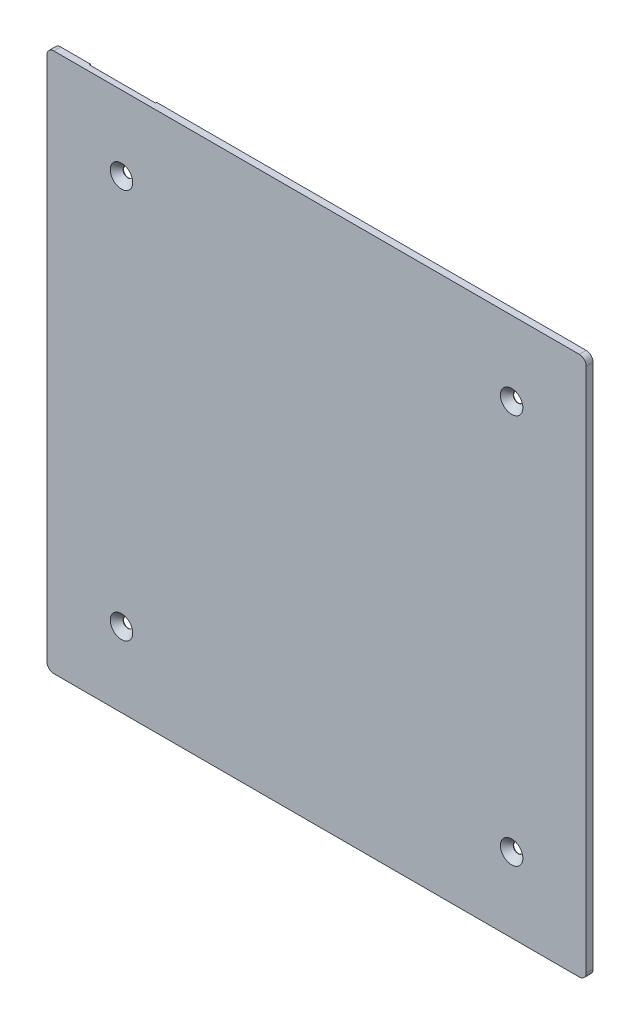
ISO-10303-21;
HEADER;
FILE_DESCRIPTION(('STEP AP214'),'2;1');
FILE_NAME('part.step','',(''),(''),'','','');
FILE_SCHEMA(('AUTOMOTIVE_DESIGN { 1 0 10303 214 1 1 1 1 }'));
ENDSEC;
DATA;
#1=APPLICATION_CONTEXT('core data for automotive mechanical design processes');
#2=APPLICATION_PROTOCOL_DEFINITION('international standard','automotive_design',2000,#1);
#3=PRODUCT_CONTEXT('',#1,'mechanical');
#4=PRODUCT('Part','Part','',(#3));
#5=PRODUCT_RELATED_PRODUCT_CATEGORY('part','',(#4));
#6=PRODUCT_DEFINITION_FORMATION('','',#4);
#7=PRODUCT_DEFINITION_CONTEXT('part definition',#1,'design');
#8=PRODUCT_DEFINITION('design','',#6,#7);
#9=PRODUCT_DEFINITION_SHAPE('','',#8);
#10=(LENGTH_UNIT() NAMED_UNIT(*) SI_UNIT(.MILLI.,.METRE.));
#11=(NAMED_UNIT(*) PLANE_ANGLE_UNIT() SI_UNIT($,.RADIAN.));
#12=(NAMED_UNIT(*) SI_UNIT($,.STERADIAN.) SOLID_ANGLE_UNIT());
#13=UNCERTAINTY_MEASURE_WITH_UNIT(LENGTH_MEASURE(1.E-05),#10,'distance_accuracy_value','');
#14=(GEOMETRIC_REPRESENTATION_CONTEXT(3) GLOBAL_UNCERTAINTY_ASSIGNED_CONTEXT((#13)) GLOBAL_UNIT_ASSIGNED_CONTEXT((#10,
#11,#12)) REPRESENTATION_CONTEXT('',''));
#15=CARTESIAN_POINT('',(0.,0.,0.));
#16=DIRECTION('',(0.,0.,1.));
#17=DIRECTION('',(1.,0.,0.));
#18=AXIS2_PLACEMENT_3D('',#15,#16,#17);
#19=CARTESIAN_POINT('',(-72.6507614869108,117.5,0.5));
#20=DIRECTION('',(1.,0.,0.));
#21=DIRECTION('',(0.,0.,-1.));
#22=AXIS2_PLACEMENT_3D('',#19,#20,#21);
#23=PLANE('',#22);
#24=DIRECTION('',(0.,0.,-1.));
#25=VECTOR('',#24,1.);
#26=CARTESIAN_POINT('',(-72.6507614869108,106.050790199477,0.5));
#27=LINE('',#26,#25);
#28=CARTESIAN_POINT('',(-72.6507614869108,106.050790199477,0.));
#29=VERTEX_POINT('',#28);
#30=CARTESIAN_POINT('',(-72.6507614869108,106.050790199477,0.5));
#31=VERTEX_POINT('',#30);
#32=EDGE_CURVE('E184',#29,#31,#27,.F.);
#33=ORIENTED_EDGE('',*,*,#32,.T.);
#34=DIRECTION('',(0.,1.,0.));
#35=VECTOR('',#34,1.);
#36=CARTESIAN_POINT('',(-72.6507614869108,0.,0.5));
#37=LINE('',#36,#35);
#38=CARTESIAN_POINT('',(-72.6507614869108,117.5,0.5));
#39=VERTEX_POINT('',#38);
#40=EDGE_CURVE('E118',#39,#31,#37,.F.);
#41=ORIENTED_EDGE('',*,*,#40,.F.);
#42=DIRECTION('',(0.,0.,-1.));
#43=VECTOR('',#42,1.);
#44=CARTESIAN_POINT('',(-72.6507614869108,117.5,0.5));
#45=LINE('',#44,#43);
#46=CARTESIAN_POINT('',(-72.6507614869108,117.5,0.));
#47=VERTEX_POINT('',#46);
#48=EDGE_CURVE('E114',#47,#39,#45,.F.);
#49=ORIENTED_EDGE('',*,*,#48,.F.);
#50=DIRECTION('',(0.,1.,0.));
#51=VECTOR('',#50,1.);
#52=CARTESIAN_POINT('',(-72.6507614869108,0.,0.));
#53=LINE('',#52,#51);
#54=EDGE_CURVE('E117',#29,#47,#53,.T.);
#55=ORIENTED_EDGE('',*,*,#54,.F.);
#56=EDGE_LOOP('',(#33,#41,#49,#55));
#57=FACE_BOUND('',#56,.T.);
#58=ADVANCED_FACE('F17',(#57),#23,.F.);
#59=CARTESIAN_POINT('',(-101.46292574176,117.5,0.5));
#60=DIRECTION('',(-1.,0.,0.));
#61=DIRECTION('',(0.,0.,1.));
#62=AXIS2_PLACEMENT_3D('',#59,#60,#61);
#63=PLANE('',#62);
#64=DIRECTION('',(0.,0.,1.));
#65=VECTOR('',#64,1.);
#66=CARTESIAN_POINT('',(-101.46292574176,117.5,0.5));
#67=LINE('',#66,#65);
#68=CARTESIAN_POINT('',(-101.46292574176,117.5,0.5));
#69=VERTEX_POINT('',#68);
#70=CARTESIAN_POINT('',(-101.46292574176,117.5,0.));
#71=VERTEX_POINT('',#70);
#72=EDGE_CURVE('E124',#69,#71,#67,.F.);
#73=ORIENTED_EDGE('',*,*,#72,.F.);
#74=DIRECTION('',(0.,1.,0.));
#75=VECTOR('',#74,1.);
#76=CARTESIAN_POINT('',(-101.46292574176,0.,0.5));
#77=LINE('',#76,#75);
#78=CARTESIAN_POINT('',(-101.46292574176,106.050790199477,0.5));
#79=VERTEX_POINT('',#78);
#80=EDGE_CURVE('E133',#79,#69,#77,.T.);
#81=ORIENTED_EDGE('',*,*,#80,.F.);
#82=DIRECTION('',(0.,0.,-1.));
#83=VECTOR('',#82,1.);
#84=CARTESIAN_POINT('',(-101.46292574176,106.050790199477,0.5));
#85=LINE('',#84,#83);
#86=CARTESIAN_POINT('',(-101.46292574176,106.050790199477,0.));
#87=VERTEX_POINT('',#86);
#88=EDGE_CURVE('E187',#79,#87,#85,.T.);
#89=ORIENTED_EDGE('',*,*,#88,.T.);
#90=DIRECTION('',(0.,1.,0.));
#91=VECTOR('',#90,1.);
#92=CARTESIAN_POINT('',(-101.46292574176,0.,0.));
#93=LINE('',#92,#91);
#94=EDGE_CURVE('E95',#71,#87,#93,.F.);
#95=ORIENTED_EDGE('',*,*,#94,.F.);
#96=EDGE_LOOP('',(#73,#81,#89,#95));
#97=FACE_BOUND('',#96,.T.);
#98=ADVANCED_FACE('F372',(#97),#63,.F.);
#99=CARTESIAN_POINT('',(-72.6507614869108,106.050790199477,0.5));
#100=DIRECTION('',(0.,-1.,0.));
#101=DIRECTION('',(0.,0.,-1.));
#102=AXIS2_PLACEMENT_3D('',#99,#100,#101);
#103=PLANE('',#102);
#104=ORIENTED_EDGE('',*,*,#88,.F.);
#105=DIRECTION('',(-1.,0.,0.));
#106=VECTOR('',#105,1.);
#107=CARTESIAN_POINT('',(0.,106.050790199477,0.5));
#108=LINE('',#107,#106);
#109=EDGE_CURVE('E202',#31,#79,#108,.T.);
#110=ORIENTED_EDGE('',*,*,#109,.F.);
#111=ORIENTED_EDGE('',*,*,#32,.F.);
#112=DIRECTION('',(-1.,0.,0.));
#113=VECTOR('',#112,1.);
#114=CARTESIAN_POINT('',(0.,106.050790199477,0.));
#115=LINE('',#114,#113);
#116=EDGE_CURVE('E131',#87,#29,#115,.F.);
#117=ORIENTED_EDGE('',*,*,#116,.F.);
#118=EDGE_LOOP('',(#104,#110,#111,#117));
#119=FACE_BOUND('',#118,.T.);
#120=ADVANCED_FACE('F285',(#119),#103,.F.);
#121=CARTESIAN_POINT('',(-85.,-85.,3.));
#122=DIRECTION('',(0.,0.,-1.));
#123=DIRECTION('',(-1.,0.,0.));
#124=AXIS2_PLACEMENT_3D('',#121,#122,#123);
#125=CYLINDRICAL_SURFACE('',#124,2.1);
#126=CARTESIAN_POINT('',(-85.,-85.,0.));
#127=DIRECTION('',(0.,0.,-1.));
#128=DIRECTION('',(-1.,0.,0.));
#129=AXIS2_PLACEMENT_3D('',#126,#127,#128);
#130=CIRCLE('',#129,2.1);
#131=CARTESIAN_POINT('',(-87.1,-85.,0.));
#132=VERTEX_POINT('',#131);
#133=EDGE_CURVE('E20',#132,#132,#130,.F.);
#134=ORIENTED_EDGE('',*,*,#133,.F.);
#135=EDGE_LOOP('',(#134));
#136=FACE_BOUND('',#135,.T.);
#137=CARTESIAN_POINT('',(-85.,-85.,0.200000000006639));
#138=DIRECTION('',(0.,0.,1.));
#139=DIRECTION('',(1.,0.,0.));
#140=AXIS2_PLACEMENT_3D('',#137,#138,#139);
#141=CIRCLE('',#140,2.09999999994806);
#142=CARTESIAN_POINT('',(-82.9000000000519,-85.,0.200000000006639));
#143=VERTEX_POINT('',#142);
#144=EDGE_CURVE('E177',#143,#143,#141,.T.);
#145=ORIENTED_EDGE('',*,*,#144,.T.);
#146=EDGE_LOOP('',(#145));
#147=FACE_BOUND('',#146,.T.);
#148=ADVANCED_FACE('F281',(#136,#147),#125,.F.);
#149=CARTESIAN_POINT('',(85.,-85.,3.));
#150=DIRECTION('',(0.,0.,-1.));
#151=DIRECTION('',(-1.,0.,0.));
#152=AXIS2_PLACEMENT_3D('',#149,#150,#151);
#153=CYLINDRICAL_SURFACE('',#152,2.1);
#154=CARTESIAN_POINT('',(85.,-85.,0.));
#155=DIRECTION('',(0.,0.,-1.));
#156=DIRECTION('',(-1.,0.,0.));
#157=AXIS2_PLACEMENT_3D('',#154,#155,#156);
#158=CIRCLE('',#157,2.1);
#159=CARTESIAN_POINT('',(82.9,-85.,0.));
#160=VERTEX_POINT('',#159);
#161=EDGE_CURVE('E181',#160,#160,#158,.F.);
#162=ORIENTED_EDGE('',*,*,#161,.F.);
#163=EDGE_LOOP('',(#162));
#164=FACE_BOUND('',#163,.T.);
#165=CARTESIAN_POINT('',(85.,-85.,0.200000000006639));
#166=DIRECTION('',(0.,0.,1.));
#167=DIRECTION('',(1.,0.,0.));
#168=AXIS2_PLACEMENT_3D('',#165,#166,#167);
#169=CIRCLE('',#168,2.09999999996396);
#170=CARTESIAN_POINT('',(87.099999999964,-85.,0.200000000006639));
#171=VERTEX_POINT('',#170);
#172=EDGE_CURVE('E173',#171,#171,#169,.T.);
#173=ORIENTED_EDGE('',*,*,#172,.T.);
#174=EDGE_LOOP('',(#173));
#175=FACE_BOUND('',#174,.T.);
#176=ADVANCED_FACE('F284',(#164,#175),#153,.F.);
#177=CARTESIAN_POINT('',(85.,85.,3.));
#178=DIRECTION('',(0.,0.,-1.));
#179=DIRECTION('',(-1.,0.,0.));
#180=AXIS2_PLACEMENT_3D('',#177,#178,#179);
#181=CYLINDRICAL_SURFACE('',#180,2.1);
#182=CARTESIAN_POINT('',(85.,85.,0.));
#183=DIRECTION('',(0.,0.,-1.));
#184=DIRECTION('',(-1.,0.,0.));
#185=AXIS2_PLACEMENT_3D('',#182,#183,#184);
#186=CIRCLE('',#185,2.1);
#187=CARTESIAN_POINT('',(82.9,85.,0.));
#188=VERTEX_POINT('',#187);
#189=EDGE_CURVE('E268',#188,#188,#186,.F.);
#190=ORIENTED_EDGE('',*,*,#189,.F.);
#191=EDGE_LOOP('',(#190));
#192=FACE_BOUND('',#191,.T.);
#193=CARTESIAN_POINT('',(85.,85.,0.200000000006639));
#194=DIRECTION('',(0.,0.,1.));
#195=DIRECTION('',(1.,0.,0.));
#196=AXIS2_PLACEMENT_3D('',#193,#194,#195);
#197=CIRCLE('',#196,2.09999999996396);
#198=CARTESIAN_POINT('',(87.099999999964,85.,0.200000000006639));
#199=VERTEX_POINT('',#198);
#200=EDGE_CURVE('E169',#199,#199,#197,.T.);
#201=ORIENTED_EDGE('',*,*,#200,.T.);
#202=EDGE_LOOP('',(#201));
#203=FACE_BOUND('',#202,.T.);
#204=ADVANCED_FACE('F355',(#192,#203),#181,.F.);
#205=CARTESIAN_POINT('',(-85.,85.,3.));
#206=DIRECTION('',(0.,0.,-1.));
#207=DIRECTION('',(-1.,0.,0.));
#208=AXIS2_PLACEMENT_3D('',#205,#206,#207);
#209=CYLINDRICAL_SURFACE('',#208,2.1);
#210=CARTESIAN_POINT('',(-85.,85.,0.));
#211=DIRECTION('',(0.,0.,-1.));
#212=DIRECTION('',(-1.,0.,0.));
#213=AXIS2_PLACEMENT_3D('',#210,#211,#212);
#214=CIRCLE('',#213,2.1);
#215=CARTESIAN_POINT('',(-87.1,85.,0.));
#216=VERTEX_POINT('',#215);
#217=EDGE_CURVE('E271',#216,#216,#214,.F.);
#218=ORIENTED_EDGE('',*,*,#217,.F.);
#219=EDGE_LOOP('',(#218));
#220=FACE_BOUND('',#219,.T.);
#221=CARTESIAN_POINT('',(-85.,85.,0.200000000006639));
#222=DIRECTION('',(0.,0.,1.));
#223=DIRECTION('',(1.,0.,0.));
#224=AXIS2_PLACEMENT_3D('',#221,#222,#223);
#225=CIRCLE('',#224,2.09999999994806);
#226=CARTESIAN_POINT('',(-82.9000000000519,85.,0.200000000006639));
#227=VERTEX_POINT('',#226);
#228=EDGE_CURVE('E165',#227,#227,#225,.T.);
#229=ORIENTED_EDGE('',*,*,#228,.T.);
#230=EDGE_LOOP('',(#229));
#231=FACE_BOUND('',#230,.T.);
#232=ADVANCED_FACE('F357',(#220,#231),#209,.F.);
#233=CARTESIAN_POINT('',(0.,0.,0.5));
#234=DIRECTION('',(0.,0.,-1.));
#235=DIRECTION('',(-1.,0.,0.));
#236=AXIS2_PLACEMENT_3D('',#233,#234,#235);
#237=PLANE('',#236);
#238=ORIENTED_EDGE('',*,*,#80,.T.);
#239=DIRECTION('',(1.,0.,0.));
#240=VECTOR('',#239,1.);
#241=CARTESIAN_POINT('',(-117.5,117.5,0.5));
#242=LINE('',#241,#240);
#243=EDGE_CURVE('E140',#69,#39,#242,.T.);
#244=ORIENTED_EDGE('',*,*,#243,.T.);
#245=ORIENTED_EDGE('',*,*,#40,.T.);
#246=ORIENTED_EDGE('',*,*,#109,.T.);
#247=EDGE_LOOP('',(#238,#244,#245,#246));
#248=FACE_BOUND('',#247,.T.);
#249=ADVANCED_FACE('F302',(#248),#237,.T.);
#250=CARTESIAN_POINT('',(0.,0.,0.));
#251=DIRECTION('',(0.,0.,-1.));
#252=DIRECTION('',(-1.,0.,0.));
#253=AXIS2_PLACEMENT_3D('',#250,#251,#252);
#254=PLANE('',#253);
#255=ORIENTED_EDGE('',*,*,#161,.T.);
#256=EDGE_LOOP('',(#255));
#257=FACE_BOUND('',#256,.T.);
#258=ORIENTED_EDGE('',*,*,#189,.T.);
#259=EDGE_LOOP('',(#258));
#260=FACE_BOUND('',#259,.T.);
#261=ORIENTED_EDGE('',*,*,#217,.T.);
#262=EDGE_LOOP('',(#261));
#263=FACE_BOUND('',#262,.T.);
#264=ORIENTED_EDGE('',*,*,#133,.T.);
#265=EDGE_LOOP('',(#264));
#266=FACE_BOUND('',#265,.T.);
#267=ORIENTED_EDGE('',*,*,#94,.T.);
#268=ORIENTED_EDGE('',*,*,#116,.T.);
#269=ORIENTED_EDGE('',*,*,#54,.T.);
#270=DIRECTION('',(1.,0.,0.));
#271=VECTOR('',#270,1.);
#272=CARTESIAN_POINT('',(-117.5,117.5,0.));
#273=LINE('',#272,#271);
#274=CARTESIAN_POINT('',(114.5,117.5,0.));
#275=VERTEX_POINT('',#274);
#276=EDGE_CURVE('E128',#47,#275,#273,.T.);
#277=ORIENTED_EDGE('',*,*,#276,.T.);
#278=CARTESIAN_POINT('',(114.5,114.5,0.));
#279=DIRECTION('',(0.,0.,-1.));
#280=DIRECTION('',(-1.,0.,0.));
#281=AXIS2_PLACEMENT_3D('',#278,#279,#280);
#282=CIRCLE('',#281,3.);
#283=CARTESIAN_POINT('',(117.5,114.5,0.));
#284=VERTEX_POINT('',#283);
#285=EDGE_CURVE('E139',#284,#275,#282,.F.);
#286=ORIENTED_EDGE('',*,*,#285,.F.);
#287=DIRECTION('',(0.,1.,0.));
#288=VECTOR('',#287,1.);
#289=CARTESIAN_POINT('',(117.5,-117.5,0.));
#290=LINE('',#289,#288);
#291=CARTESIAN_POINT('',(117.5,-114.5,0.));
#292=VERTEX_POINT('',#291);
#293=EDGE_CURVE('E150',#284,#292,#290,.F.);
#294=ORIENTED_EDGE('',*,*,#293,.T.);
#295=CARTESIAN_POINT('',(114.5,-114.5,0.));
#296=DIRECTION('',(0.,0.,-1.));
#297=DIRECTION('',(-1.,0.,0.));
#298=AXIS2_PLACEMENT_3D('',#295,#296,#297);
#299=CIRCLE('',#298,3.);
#300=CARTESIAN_POINT('',(114.5,-117.5,0.));
#301=VERTEX_POINT('',#300);
#302=EDGE_CURVE('E259',#301,#292,#299,.F.);
#303=ORIENTED_EDGE('',*,*,#302,.F.);
#304=DIRECTION('',(1.,0.,0.));
#305=VECTOR('',#304,1.);
#306=CARTESIAN_POINT('',(-117.5,-117.5,0.));
#307=LINE('',#306,#305);
#308=CARTESIAN_POINT('',(-114.5,-117.5,0.));
#309=VERTEX_POINT('',#308);
#310=EDGE_CURVE('E258',#301,#309,#307,.F.);
#311=ORIENTED_EDGE('',*,*,#310,.T.);
#312=CARTESIAN_POINT('',(-114.5,-114.5,0.));
#313=DIRECTION('',(0.,0.,-1.));
#314=DIRECTION('',(-1.,0.,0.));
#315=AXIS2_PLACEMENT_3D('',#312,#313,#314);
#316=CIRCLE('',#315,3.);
#317=CARTESIAN_POINT('',(-117.5,-114.5,0.));
#318=VERTEX_POINT('',#317);
#319=EDGE_CURVE('E254',#318,#309,#316,.F.);
#320=ORIENTED_EDGE('',*,*,#319,.F.);
#321=DIRECTION('',(0.,1.,0.));
#322=VECTOR('',#321,1.);
#323=CARTESIAN_POINT('',(-117.5,-117.5,0.));
#324=LINE('',#323,#322);
#325=CARTESIAN_POINT('',(-117.5,114.5,0.));
#326=VERTEX_POINT('',#325);
#327=EDGE_CURVE('E253',#318,#326,#324,.T.);
#328=ORIENTED_EDGE('',*,*,#327,.T.);
#329=CARTESIAN_POINT('',(-114.5,114.5,0.));
#330=DIRECTION('',(0.,0.,-1.));
#331=DIRECTION('',(-1.,0.,0.));
#332=AXIS2_PLACEMENT_3D('',#329,#330,#331);
#333=CIRCLE('',#332,3.);
#334=CARTESIAN_POINT('',(-114.5,117.5,0.));
#335=VERTEX_POINT('',#334);
#336=EDGE_CURVE('E85',#335,#326,#333,.F.);
#337=ORIENTED_EDGE('',*,*,#336,.F.);
#338=DIRECTION('',(1.,0.,0.));
#339=VECTOR('',#338,1.);
#340=CARTESIAN_POINT('',(-117.5,117.5,0.));
#341=LINE('',#340,#339);
#342=EDGE_CURVE('E146',#335,#71,#341,.T.);
#343=ORIENTED_EDGE('',*,*,#342,.T.);
#344=EDGE_LOOP('',(#267,#268,#269,#277,#286,#294,#303,#311,#320,#328,#337,#343));
#345=FACE_BOUND('',#344,.T.);
#346=ADVANCED_FACE('F127',(#257,#260,#263,#266,#345),#254,.T.);
#347=CARTESIAN_POINT('',(-85.,-85.,2.9999999999859));
#348=DIRECTION('',(0.,0.,1.));
#349=DIRECTION('',(1.,0.,0.));
#350=AXIS2_PLACEMENT_3D('',#347,#348,#349);
#351=CONICAL_SURFACE('',#350,4.89999999998417,0.785398163407599);
#352=CARTESIAN_POINT('',(-85.,-85.,3.00000000002229));
#353=DIRECTION('',(0.,0.,1.));
#354=DIRECTION('',(1.,0.,0.));
#355=AXIS2_PLACEMENT_3D('',#352,#353,#354);
#356=CIRCLE('',#355,4.90000000002055);
#357=CARTESIAN_POINT('',(-80.0999999999794,-85.,3.00000000002229));
#358=VERTEX_POINT('',#357);
#359=EDGE_CURVE('E249',#358,#358,#356,.T.);
#360=ORIENTED_EDGE('',*,*,#359,.T.);
#361=EDGE_LOOP('',(#360));
#362=FACE_BOUND('',#361,.T.);
#363=ORIENTED_EDGE('',*,*,#144,.F.);
#364=EDGE_LOOP('',(#363));
#365=FACE_BOUND('',#364,.T.);
#366=ADVANCED_FACE('F289',(#362,#365),#351,.F.);
#367=CARTESIAN_POINT('',(85.,-85.,2.99999999987222));
#368=DIRECTION('',(0.,0.,1.));
#369=DIRECTION('',(0.,-1.,0.));
#370=AXIS2_PLACEMENT_3D('',#367,#368,#369);
#371=CONICAL_SURFACE('',#370,4.89999999988638,0.785398163397448);
#372=CARTESIAN_POINT('',(85.,-85.,2.9999999999859));
#373=DIRECTION('',(0.,0.,1.));
#374=DIRECTION('',(0.,-1.,0.));
#375=AXIS2_PLACEMENT_3D('',#372,#373,#374);
#376=CIRCLE('',#375,4.90000000000007);
#377=CARTESIAN_POINT('',(85.,-89.9000000000001,2.9999999999859));
#378=VERTEX_POINT('',#377);
#379=EDGE_CURVE('E245',#378,#378,#376,.T.);
#380=ORIENTED_EDGE('',*,*,#379,.T.);
#381=EDGE_LOOP('',(#380));
#382=FACE_BOUND('',#381,.T.);
#383=ORIENTED_EDGE('',*,*,#172,.F.);
#384=EDGE_LOOP('',(#383));
#385=FACE_BOUND('',#384,.T.);
#386=ADVANCED_FACE('F291',(#382,#385),#371,.F.);
#387=CARTESIAN_POINT('',(85.,85.,2.99999999987222));
#388=DIRECTION('',(0.,0.,1.));
#389=DIRECTION('',(0.,-1.,0.));
#390=AXIS2_PLACEMENT_3D('',#387,#388,#389);
#391=CONICAL_SURFACE('',#390,4.89999999988638,0.785398163397448);
#392=CARTESIAN_POINT('',(85.,85.,2.9999999999859));
#393=DIRECTION('',(0.,0.,1.));
#394=DIRECTION('',(0.,-1.,0.));
#395=AXIS2_PLACEMENT_3D('',#392,#393,#394);
#396=CIRCLE('',#395,4.90000000000007);
#397=CARTESIAN_POINT('',(85.,80.1,2.9999999999859));
#398=VERTEX_POINT('',#397);
#399=EDGE_CURVE('E241',#398,#398,#396,.T.);
#400=ORIENTED_EDGE('',*,*,#399,.T.);
#401=EDGE_LOOP('',(#400));
#402=FACE_BOUND('',#401,.T.);
#403=ORIENTED_EDGE('',*,*,#200,.F.);
#404=EDGE_LOOP('',(#403));
#405=FACE_BOUND('',#404,.T.);
#406=ADVANCED_FACE('F299',(#402,#405),#391,.F.);
#407=CARTESIAN_POINT('',(-85.,85.,2.9999999999859));
#408=DIRECTION('',(0.,0.,1.));
#409=DIRECTION('',(1.,0.,0.));
#410=AXIS2_PLACEMENT_3D('',#407,#408,#409);
#411=CONICAL_SURFACE('',#410,4.89999999998417,0.785398163407599);
#412=CARTESIAN_POINT('',(-85.,85.,3.00000000002229));
#413=DIRECTION('',(0.,0.,1.));
#414=DIRECTION('',(1.,0.,0.));
#415=AXIS2_PLACEMENT_3D('',#412,#413,#414);
#416=CIRCLE('',#415,4.90000000002055);
#417=CARTESIAN_POINT('',(-80.0999999999794,85.,3.00000000002229));
#418=VERTEX_POINT('',#417);
#419=EDGE_CURVE('E237',#418,#418,#416,.T.);
#420=ORIENTED_EDGE('',*,*,#419,.T.);
#421=EDGE_LOOP('',(#420));
#422=FACE_BOUND('',#421,.T.);
#423=ORIENTED_EDGE('',*,*,#228,.F.);
#424=EDGE_LOOP('',(#423));
#425=FACE_BOUND('',#424,.T.);
#426=ADVANCED_FACE('F342',(#422,#425),#411,.F.);
#427=CARTESIAN_POINT('',(-114.5,114.5,3.));
#428=DIRECTION('',(0.,0.,-1.));
#429=DIRECTION('',(-1.,0.,0.));
#430=AXIS2_PLACEMENT_3D('',#427,#428,#429);
#431=CYLINDRICAL_SURFACE('',#430,3.);
#432=ORIENTED_EDGE('',*,*,#336,.T.);
#433=DIRECTION('',(0.,0.,-1.));
#434=VECTOR('',#433,1.);
#435=CARTESIAN_POINT('',(-117.5,114.5,3.));
#436=LINE('',#435,#434);
#437=CARTESIAN_POINT('',(-117.5,114.5,3.));
#438=VERTEX_POINT('',#437);
#439=EDGE_CURVE('E553',#326,#438,#436,.F.);
#440=ORIENTED_EDGE('',*,*,#439,.T.);
#441=CARTESIAN_POINT('',(-114.5,114.5,3.));
#442=DIRECTION('',(0.,0.,-1.));
#443=DIRECTION('',(-1.,0.,0.));
#444=AXIS2_PLACEMENT_3D('',#441,#442,#443);
#445=CIRCLE('',#444,3.);
#446=CARTESIAN_POINT('',(-114.5,117.5,3.));
#447=VERTEX_POINT('',#446);
#448=EDGE_CURVE('E233',#438,#447,#445,.T.);
#449=ORIENTED_EDGE('',*,*,#448,.T.);
#450=DIRECTION('',(0.,0.,-1.));
#451=VECTOR('',#450,1.);
#452=CARTESIAN_POINT('',(-114.5,117.5,3.));
#453=LINE('',#452,#451);
#454=EDGE_CURVE('E158',#447,#335,#453,.T.);
#455=ORIENTED_EDGE('',*,*,#454,.T.);
#456=EDGE_LOOP('',(#432,#440,#449,#455));
#457=FACE_BOUND('',#456,.T.);
#458=ADVANCED_FACE('F339',(#457),#431,.T.);
#459=CARTESIAN_POINT('',(-117.5,117.5,3.));
#460=DIRECTION('',(0.,-1.,0.));
#461=DIRECTION('',(0.,0.,-1.));
#462=AXIS2_PLACEMENT_3D('',#459,#460,#461);
#463=PLANE('',#462);
#464=ORIENTED_EDGE('',*,*,#48,.T.);
#465=ORIENTED_EDGE('',*,*,#243,.F.);
#466=ORIENTED_EDGE('',*,*,#72,.T.);
#467=ORIENTED_EDGE('',*,*,#342,.F.);
#468=ORIENTED_EDGE('',*,*,#454,.F.);
#469=DIRECTION('',(-1.,0.,0.));
#470=VECTOR('',#469,1.);
#471=CARTESIAN_POINT('',(0.,117.5,3.));
#472=LINE('',#471,#470);
#473=CARTESIAN_POINT('',(114.5,117.5,3.));
#474=VERTEX_POINT('',#473);
#475=EDGE_CURVE('E232',#447,#474,#472,.F.);
#476=ORIENTED_EDGE('',*,*,#475,.T.);
#477=DIRECTION('',(0.,0.,-1.));
#478=VECTOR('',#477,1.);
#479=CARTESIAN_POINT('',(114.5,117.5,3.));
#480=LINE('',#479,#478);
#481=EDGE_CURVE('E137',#275,#474,#480,.F.);
#482=ORIENTED_EDGE('',*,*,#481,.F.);
#483=ORIENTED_EDGE('',*,*,#276,.F.);
#484=EDGE_LOOP('',(#464,#465,#466,#467,#468,#476,#482,#483));
#485=FACE_BOUND('',#484,.T.);
#486=ADVANCED_FACE('F135',(#485),#463,.F.);
#487=CARTESIAN_POINT('',(114.5,114.5,3.));
#488=DIRECTION('',(0.,0.,-1.));
#489=DIRECTION('',(-1.,0.,0.));
#490=AXIS2_PLACEMENT_3D('',#487,#488,#489);
#491=CYLINDRICAL_SURFACE('',#490,3.);
#492=ORIENTED_EDGE('',*,*,#285,.T.);
#493=ORIENTED_EDGE('',*,*,#481,.T.);
#494=CARTESIAN_POINT('',(114.5,114.5,3.));
#495=DIRECTION('',(0.,0.,-1.));
#496=DIRECTION('',(-1.,0.,0.));
#497=AXIS2_PLACEMENT_3D('',#494,#495,#496);
#498=CIRCLE('',#497,3.);
#499=CARTESIAN_POINT('',(117.5,114.5,3.));
#500=VERTEX_POINT('',#499);
#501=EDGE_CURVE('E228',#474,#500,#498,.T.);
#502=ORIENTED_EDGE('',*,*,#501,.T.);
#503=DIRECTION('',(0.,0.,1.));
#504=VECTOR('',#503,1.);
#505=CARTESIAN_POINT('',(117.5,114.5,3.));
#506=LINE('',#505,#504);
#507=EDGE_CURVE('E537',#500,#284,#506,.F.);
#508=ORIENTED_EDGE('',*,*,#507,.T.);
#509=EDGE_LOOP('',(#492,#493,#502,#508));
#510=FACE_BOUND('',#509,.T.);
#511=ADVANCED_FACE('F332',(#510),#491,.T.);
#512=CARTESIAN_POINT('',(117.5,-117.5,3.));
#513=DIRECTION('',(-1.,0.,0.));
#514=DIRECTION('',(0.,0.,1.));
#515=AXIS2_PLACEMENT_3D('',#512,#513,#514);
#516=PLANE('',#515);
#517=DIRECTION('',(0.,0.,-1.));
#518=VECTOR('',#517,1.);
#519=CARTESIAN_POINT('',(117.5,-114.5,3.));
#520=LINE('',#519,#518);
#521=CARTESIAN_POINT('',(117.5,-114.5,3.));
#522=VERTEX_POINT('',#521);
#523=EDGE_CURVE('E261',#292,#522,#520,.F.);
#524=ORIENTED_EDGE('',*,*,#523,.F.);
#525=ORIENTED_EDGE('',*,*,#293,.F.);
#526=ORIENTED_EDGE('',*,*,#507,.F.);
#527=DIRECTION('',(0.,1.,0.));
#528=VECTOR('',#527,1.);
#529=CARTESIAN_POINT('',(117.5,0.,3.));
#530=LINE('',#529,#528);
#531=EDGE_CURVE('E227',#500,#522,#530,.F.);
#532=ORIENTED_EDGE('',*,*,#531,.T.);
#533=EDGE_LOOP('',(#524,#525,#526,#532));
#534=FACE_BOUND('',#533,.T.);
#535=ADVANCED_FACE('F328',(#534),#516,.F.);
#536=CARTESIAN_POINT('',(114.5,-114.5,3.));
#537=DIRECTION('',(0.,0.,-1.));
#538=DIRECTION('',(-1.,0.,0.));
#539=AXIS2_PLACEMENT_3D('',#536,#537,#538);
#540=CYLINDRICAL_SURFACE('',#539,3.);
#541=ORIENTED_EDGE('',*,*,#302,.T.);
#542=ORIENTED_EDGE('',*,*,#523,.T.);
#543=CARTESIAN_POINT('',(114.5,-114.5,3.));
#544=DIRECTION('',(0.,0.,-1.));
#545=DIRECTION('',(-1.,0.,0.));
#546=AXIS2_PLACEMENT_3D('',#543,#544,#545);
#547=CIRCLE('',#546,3.);
#548=CARTESIAN_POINT('',(114.5,-117.5,3.));
#549=VERTEX_POINT('',#548);
#550=EDGE_CURVE('E223',#522,#549,#547,.T.);
#551=ORIENTED_EDGE('',*,*,#550,.T.);
#552=DIRECTION('',(0.,0.,1.));
#553=VECTOR('',#552,1.);
#554=CARTESIAN_POINT('',(114.5,-117.5,3.));
#555=LINE('',#554,#553);
#556=EDGE_CURVE('E527',#549,#301,#555,.F.);
#557=ORIENTED_EDGE('',*,*,#556,.T.);
#558=EDGE_LOOP('',(#541,#542,#551,#557));
#559=FACE_BOUND('',#558,.T.);
#560=ADVANCED_FACE('F324',(#559),#540,.T.);
#561=CARTESIAN_POINT('',(-117.5,-117.5,3.));
#562=DIRECTION('',(0.,1.,0.));
#563=DIRECTION('',(0.,0.,1.));
#564=AXIS2_PLACEMENT_3D('',#561,#562,#563);
#565=PLANE('',#564);
#566=DIRECTION('',(0.,0.,-1.));
#567=VECTOR('',#566,1.);
#568=CARTESIAN_POINT('',(-114.5,-117.5,3.));
#569=LINE('',#568,#567);
#570=CARTESIAN_POINT('',(-114.5,-117.5,3.));
#571=VERTEX_POINT('',#570);
#572=EDGE_CURVE('E257',#309,#571,#569,.F.);
#573=ORIENTED_EDGE('',*,*,#572,.F.);
#574=ORIENTED_EDGE('',*,*,#310,.F.);
#575=ORIENTED_EDGE('',*,*,#556,.F.);
#576=DIRECTION('',(-1.,0.,0.));
#577=VECTOR('',#576,1.);
#578=CARTESIAN_POINT('',(0.,-117.5,3.));
#579=LINE('',#578,#577);
#580=EDGE_CURVE('E222',#549,#571,#579,.T.);
#581=ORIENTED_EDGE('',*,*,#580,.T.);
#582=EDGE_LOOP('',(#573,#574,#575,#581));
#583=FACE_BOUND('',#582,.T.);
#584=ADVANCED_FACE('F320',(#583),#565,.F.);
#585=CARTESIAN_POINT('',(-114.5,-114.5,3.));
#586=DIRECTION('',(0.,0.,-1.));
#587=DIRECTION('',(-1.,0.,0.));
#588=AXIS2_PLACEMENT_3D('',#585,#586,#587);
#589=CYLINDRICAL_SURFACE('',#588,3.);
#590=ORIENTED_EDGE('',*,*,#319,.T.);
#591=ORIENTED_EDGE('',*,*,#572,.T.);
#592=CARTESIAN_POINT('',(-114.5,-114.5,3.));
#593=DIRECTION('',(0.,0.,-1.));
#594=DIRECTION('',(-1.,0.,0.));
#595=AXIS2_PLACEMENT_3D('',#592,#593,#594);
#596=CIRCLE('',#595,3.);
#597=CARTESIAN_POINT('',(-117.5,-114.5,3.));
#598=VERTEX_POINT('',#597);
#599=EDGE_CURVE('E27',#571,#598,#596,.T.);
#600=ORIENTED_EDGE('',*,*,#599,.T.);
#601=DIRECTION('',(0.,0.,-1.));
#602=VECTOR('',#601,1.);
#603=CARTESIAN_POINT('',(-117.5,-114.5,3.));
#604=LINE('',#603,#602);
#605=EDGE_CURVE('E35',#598,#318,#604,.T.);
#606=ORIENTED_EDGE('',*,*,#605,.T.);
#607=EDGE_LOOP('',(#590,#591,#600,#606));
#608=FACE_BOUND('',#607,.T.);
#609=ADVANCED_FACE('F313',(#608),#589,.T.);
#610=CARTESIAN_POINT('',(-117.5,-117.5,3.));
#611=DIRECTION('',(1.,0.,0.));
#612=DIRECTION('',(0.,0.,-1.));
#613=AXIS2_PLACEMENT_3D('',#610,#611,#612);
#614=PLANE('',#613);
#615=ORIENTED_EDGE('',*,*,#605,.F.);
#616=DIRECTION('',(0.,1.,0.));
#617=VECTOR('',#616,1.);
#618=CARTESIAN_POINT('',(-117.5,0.,3.));
#619=LINE('',#618,#617);
#620=EDGE_CURVE('E10',#598,#438,#619,.T.);
#621=ORIENTED_EDGE('',*,*,#620,.T.);
#622=ORIENTED_EDGE('',*,*,#439,.F.);
#623=ORIENTED_EDGE('',*,*,#327,.F.);
#624=EDGE_LOOP('',(#615,#621,#622,#623));
#625=FACE_BOUND('',#624,.T.);
#626=ADVANCED_FACE('F307',(#625),#614,.F.);
#627=CARTESIAN_POINT('',(0.,0.,3.));
#628=DIRECTION('',(0.,0.,-1.));
#629=DIRECTION('',(-1.,0.,0.));
#630=AXIS2_PLACEMENT_3D('',#627,#628,#629);
#631=PLANE('',#630);
#632=ORIENTED_EDGE('',*,*,#599,.F.);
#633=ORIENTED_EDGE('',*,*,#580,.F.);
#634=ORIENTED_EDGE('',*,*,#550,.F.);
#635=ORIENTED_EDGE('',*,*,#531,.F.);
#636=ORIENTED_EDGE('',*,*,#501,.F.);
#637=ORIENTED_EDGE('',*,*,#475,.F.);
#638=ORIENTED_EDGE('',*,*,#448,.F.);
#639=ORIENTED_EDGE('',*,*,#620,.F.);
#640=EDGE_LOOP('',(#632,#633,#634,#635,#636,#637,#638,#639));
#641=FACE_BOUND('',#640,.T.);
#642=ORIENTED_EDGE('',*,*,#419,.F.);
#643=EDGE_LOOP('',(#642));
#644=FACE_BOUND('',#643,.T.);
#645=ORIENTED_EDGE('',*,*,#399,.F.);
#646=EDGE_LOOP('',(#645));
#647=FACE_BOUND('',#646,.T.);
#648=ORIENTED_EDGE('',*,*,#379,.F.);
#649=EDGE_LOOP('',(#648));
#650=FACE_BOUND('',#649,.T.);
#651=ORIENTED_EDGE('',*,*,#359,.F.);
#652=EDGE_LOOP('',(#651));
#653=FACE_BOUND('',#652,.T.);
#654=ADVANCED_FACE('F305',(#641,#644,#647,#650,#653),#631,.F.);
#655=CLOSED_SHELL('',(#58,#98,#120,#148,#176,#204,#232,#249,#346,#366,#386,#406,#426,#458,#486,
#511,#535,#560,#584,#609,#626,#654));
#656=MANIFOLD_SOLID_BREP('B1',#655);
#657=ADVANCED_BREP_SHAPE_REPRESENTATION('',(#18,#656),#14);
#658=SHAPE_DEFINITION_REPRESENTATION(#9,#657);
ENDSEC;
END-ISO-10303-21;
